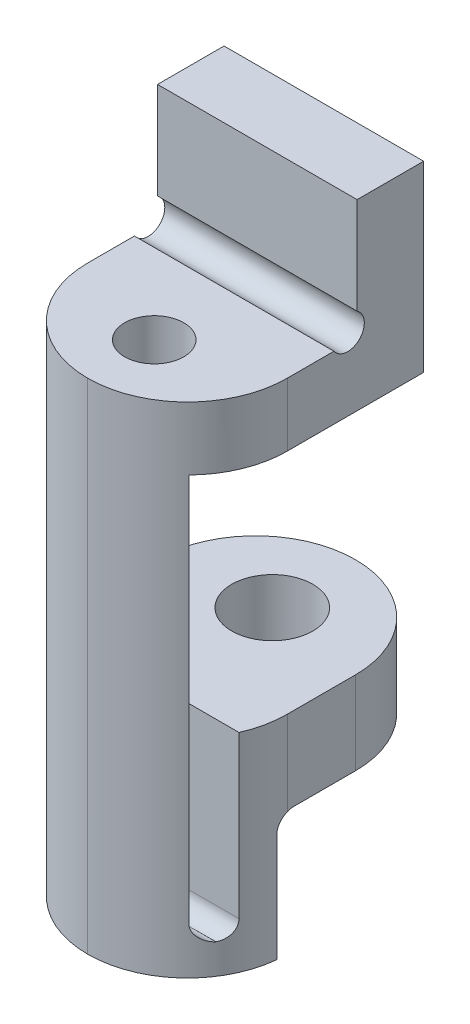
ISO-10303-21;
HEADER;
FILE_DESCRIPTION(('STEP AP214'),'2;1');
FILE_NAME('part.step','',(''),(''),'','','');
FILE_SCHEMA(('AUTOMOTIVE_DESIGN { 1 0 10303 214 1 1 1 1 }'));
ENDSEC;
DATA;
#1=APPLICATION_CONTEXT('core data for automotive mechanical design processes');
#2=APPLICATION_PROTOCOL_DEFINITION('international standard','automotive_design',2000,#1);
#3=PRODUCT_CONTEXT('',#1,'mechanical');
#4=PRODUCT('Part','Part','',(#3));
#5=PRODUCT_RELATED_PRODUCT_CATEGORY('part','',(#4));
#6=PRODUCT_DEFINITION_FORMATION('','',#4);
#7=PRODUCT_DEFINITION_CONTEXT('part definition',#1,'design');
#8=PRODUCT_DEFINITION('design','',#6,#7);
#9=PRODUCT_DEFINITION_SHAPE('','',#8);
#10=(LENGTH_UNIT() NAMED_UNIT(*) SI_UNIT(.MILLI.,.METRE.));
#11=(NAMED_UNIT(*) PLANE_ANGLE_UNIT() SI_UNIT($,.RADIAN.));
#12=(NAMED_UNIT(*) SI_UNIT($,.STERADIAN.) SOLID_ANGLE_UNIT());
#13=UNCERTAINTY_MEASURE_WITH_UNIT(LENGTH_MEASURE(1.E-05),#10,'distance_accuracy_value','');
#14=(GEOMETRIC_REPRESENTATION_CONTEXT(3) GLOBAL_UNCERTAINTY_ASSIGNED_CONTEXT((#13)) GLOBAL_UNIT_ASSIGNED_CONTEXT((#10,
#11,#12)) REPRESENTATION_CONTEXT('',''));
#15=CARTESIAN_POINT('',(0.,0.,0.));
#16=DIRECTION('',(0.,0.,1.));
#17=DIRECTION('',(1.,0.,0.));
#18=AXIS2_PLACEMENT_3D('',#15,#16,#17);
#19=CARTESIAN_POINT('',(1.5,14.5646092602186,0.));
#20=DIRECTION('',(0.,-1.,0.));
#21=DIRECTION('',(0.,0.,-1.));
#22=AXIS2_PLACEMENT_3D('',#19,#20,#21);
#23=PLANE('',#22);
#24=DIRECTION('',(0.,0.,-1.));
#25=VECTOR('',#24,1.);
#26=CARTESIAN_POINT('',(7.5,14.5646092602186,0.));
#27=LINE('',#26,#25);
#28=CARTESIAN_POINT('',(7.5,14.5646092602186,3.90203900205682));
#29=VERTEX_POINT('',#28);
#30=CARTESIAN_POINT('',(7.5,14.5646092602186,2.4971922770932));
#31=VERTEX_POINT('',#30);
#32=EDGE_CURVE('E219',#29,#31,#27,.T.);
#33=ORIENTED_EDGE('',*,*,#32,.T.);
#34=DIRECTION('',(1.,0.,0.));
#35=VECTOR('',#34,1.);
#36=CARTESIAN_POINT('',(-2.5,14.5646092602186,2.4971922770932));
#37=LINE('',#36,#35);
#38=CARTESIAN_POINT('',(1.5,14.5646092602186,2.4971922770932));
#39=VERTEX_POINT('',#38);
#40=EDGE_CURVE('E197',#31,#39,#37,.F.);
#41=ORIENTED_EDGE('',*,*,#40,.T.);
#42=DIRECTION('',(0.,0.,-1.));
#43=VECTOR('',#42,1.);
#44=CARTESIAN_POINT('',(1.5,14.5646092602186,0.));
#45=LINE('',#44,#43);
#46=CARTESIAN_POINT('',(1.5,14.5646092602186,3.90203900205682));
#47=VERTEX_POINT('',#46);
#48=EDGE_CURVE('E493',#47,#39,#45,.T.);
#49=ORIENTED_EDGE('',*,*,#48,.F.);
#50=CARTESIAN_POINT('',(4.5,14.5646092602186,3.90203900205682));
#51=DIRECTION('',(0.,-1.,0.));
#52=DIRECTION('',(0.,0.,-1.));
#53=AXIS2_PLACEMENT_3D('',#50,#51,#52);
#54=CIRCLE('',#53,3.);
#55=CARTESIAN_POINT('',(4.5,14.5646092602186,6.90203900205682));
#56=VERTEX_POINT('',#55);
#57=EDGE_CURVE('E327',#47,#56,#54,.F.);
#58=ORIENTED_EDGE('',*,*,#57,.T.);
#59=CARTESIAN_POINT('',(4.5,14.5646092602186,3.90203900205682));
#60=DIRECTION('',(0.,-1.,0.));
#61=DIRECTION('',(0.,0.,-1.));
#62=AXIS2_PLACEMENT_3D('',#59,#60,#61);
#63=CIRCLE('',#62,3.);
#64=EDGE_CURVE('E324',#56,#29,#63,.F.);
#65=ORIENTED_EDGE('',*,*,#64,.T.);
#66=EDGE_LOOP('',(#33,#41,#49,#58,#65));
#67=FACE_BOUND('',#66,.T.);
#68=CARTESIAN_POINT('',(4.5,14.5646092602186,4.90203900205682));
#69=DIRECTION('',(0.,1.,0.));
#70=DIRECTION('',(0.,0.,1.));
#71=AXIS2_PLACEMENT_3D('',#68,#69,#70);
#72=CIRCLE('',#71,0.888999999999999);
#73=CARTESIAN_POINT('',(4.5,14.5646092602186,5.79103900205682));
#74=VERTEX_POINT('',#73);
#75=EDGE_CURVE('E593',#74,#74,#72,.T.);
#76=ORIENTED_EDGE('',*,*,#75,.F.);
#77=EDGE_LOOP('',(#76));
#78=FACE_BOUND('',#77,.T.);
#79=ADVANCED_FACE('F46',(#67,#78),#23,.F.);
#80=CARTESIAN_POINT('',(7.5,0.,0.));
#81=DIRECTION('',(1.,0.,0.));
#82=DIRECTION('',(0.,0.,-1.));
#83=AXIS2_PLACEMENT_3D('',#80,#81,#82);
#84=PLANE('',#83);
#85=CARTESIAN_POINT('',(7.5,14.8474519726932,2.08488171453144));
#86=DIRECTION('',(1.,0.,0.));
#87=DIRECTION('',(0.,0.,-1.));
#88=AXIS2_PLACEMENT_3D('',#85,#86,#87);
#89=CIRCLE('',#88,0.5);
#90=CARTESIAN_POINT('',(7.5,15.259762535255,1.80203900205682));
#91=VERTEX_POINT('',#90);
#92=EDGE_CURVE('E191',#31,#91,#89,.T.);
#93=ORIENTED_EDGE('',*,*,#92,.F.);
#94=ORIENTED_EDGE('',*,*,#32,.F.);
#95=DIRECTION('',(0.,-1.,0.));
#96=VECTOR('',#95,1.);
#97=CARTESIAN_POINT('',(7.5,0.,3.90203900205681));
#98=LINE('',#97,#96);
#99=CARTESIAN_POINT('',(7.5,12.6646092602186,3.90203900205682));
#100=VERTEX_POINT('',#99);
#101=EDGE_CURVE('E285',#29,#100,#98,.T.);
#102=ORIENTED_EDGE('',*,*,#101,.T.);
#103=DIRECTION('',(0.,0.,1.));
#104=VECTOR('',#103,1.);
#105=CARTESIAN_POINT('',(7.5,12.6646092602186,0.));
#106=LINE('',#105,#104);
#107=CARTESIAN_POINT('',(7.5,12.6646092602186,-0.197960997943182));
#108=VERTEX_POINT('',#107);
#109=EDGE_CURVE('E501',#108,#100,#106,.T.);
#110=ORIENTED_EDGE('',*,*,#109,.F.);
#111=DIRECTION('',(0.,-1.,0.));
#112=VECTOR('',#111,1.);
#113=CARTESIAN_POINT('',(7.5,0.,-0.197960997943184));
#114=LINE('',#113,#112);
#115=CARTESIAN_POINT('',(7.5,18.1646092602186,-0.197960997943181));
#116=VERTEX_POINT('',#115);
#117=EDGE_CURVE('E225',#116,#108,#114,.T.);
#118=ORIENTED_EDGE('',*,*,#117,.F.);
#119=DIRECTION('',(0.,0.,1.));
#120=VECTOR('',#119,1.);
#121=CARTESIAN_POINT('',(7.5,18.1646092602186,0.));
#122=LINE('',#121,#120);
#123=CARTESIAN_POINT('',(7.5,18.1646092602186,1.80203900205682));
#124=VERTEX_POINT('',#123);
#125=EDGE_CURVE('E217',#116,#124,#122,.T.);
#126=ORIENTED_EDGE('',*,*,#125,.T.);
#127=DIRECTION('',(0.,-1.,0.));
#128=VECTOR('',#127,1.);
#129=CARTESIAN_POINT('',(7.5,0.,1.80203900205682));
#130=LINE('',#129,#128);
#131=EDGE_CURVE('E208',#124,#91,#130,.T.);
#132=ORIENTED_EDGE('',*,*,#131,.T.);
#133=EDGE_LOOP('',(#93,#94,#102,#110,#118,#126,#132));
#134=FACE_BOUND('',#133,.T.);
#135=ADVANCED_FACE('F214',(#134),#84,.T.);
#136=CARTESIAN_POINT('',(1.5,0.,0.));
#137=DIRECTION('',(1.,0.,0.));
#138=DIRECTION('',(0.,0.,-1.));
#139=AXIS2_PLACEMENT_3D('',#136,#137,#138);
#140=PLANE('',#139);
#141=DIRECTION('',(0.,0.,1.));
#142=VECTOR('',#141,1.);
#143=CARTESIAN_POINT('',(1.5,5.81460926021861,0.));
#144=LINE('',#143,#142);
#145=CARTESIAN_POINT('',(1.5,5.81460926021861,1.85203900205682));
#146=VERTEX_POINT('',#145);
#147=CARTESIAN_POINT('',(1.5,5.81460926021861,3.90203900205682));
#148=VERTEX_POINT('',#147);
#149=EDGE_CURVE('E231',#146,#148,#144,.T.);
#150=ORIENTED_EDGE('',*,*,#149,.F.);
#151=DIRECTION('',(0.,-1.,0.));
#152=VECTOR('',#151,1.);
#153=CARTESIAN_POINT('',(1.5,0.,1.85203900205682));
#154=LINE('',#153,#152);
#155=CARTESIAN_POINT('',(1.5,3.31460926021861,1.85203900205682));
#156=VERTEX_POINT('',#155);
#157=EDGE_CURVE('E260',#146,#156,#154,.T.);
#158=ORIENTED_EDGE('',*,*,#157,.T.);
#159=DIRECTION('',(0.,0.,-1.));
#160=VECTOR('',#159,1.);
#161=CARTESIAN_POINT('',(1.5,3.31460926021861,0.));
#162=LINE('',#161,#160);
#163=CARTESIAN_POINT('',(1.5,3.31460926021861,3.70203900205682));
#164=VERTEX_POINT('',#163);
#165=EDGE_CURVE('E255',#164,#156,#162,.T.);
#166=ORIENTED_EDGE('',*,*,#165,.F.);
#167=CARTESIAN_POINT('',(1.5,2.81460926021861,3.70203900205682));
#168=DIRECTION('',(1.,0.,0.));
#169=DIRECTION('',(0.,0.,-1.));
#170=AXIS2_PLACEMENT_3D('',#167,#168,#169);
#171=CIRCLE('',#170,0.5);
#172=CARTESIAN_POINT('',(1.5,3.27286682971476,3.90203900205681));
#173=VERTEX_POINT('',#172);
#174=EDGE_CURVE('E57',#164,#173,#171,.T.);
#175=ORIENTED_EDGE('',*,*,#174,.T.);
#176=DIRECTION('',(0.,-1.,0.));
#177=VECTOR('',#176,1.);
#178=CARTESIAN_POINT('',(1.5,14.5646092602186,3.90203900205682));
#179=LINE('',#178,#177);
#180=EDGE_CURVE('E63',#173,#148,#179,.F.);
#181=ORIENTED_EDGE('',*,*,#180,.T.);
#182=EDGE_LOOP('',(#150,#158,#166,#175,#181));
#183=FACE_BOUND('',#182,.T.);
#184=ADVANCED_FACE('F418',(#183),#140,.F.);
#185=CARTESIAN_POINT('',(1.5,3.31460926021861,0.));
#186=DIRECTION('',(0.,-1.,0.));
#187=DIRECTION('',(0.,0.,-1.));
#188=AXIS2_PLACEMENT_3D('',#185,#186,#187);
#189=PLANE('',#188);
#190=CARTESIAN_POINT('',(4.5,3.31460926021861,1.35203900205682));
#191=DIRECTION('',(0.,-1.,0.));
#192=DIRECTION('',(0.,0.,-1.));
#193=AXIS2_PLACEMENT_3D('',#190,#191,#192);
#194=CIRCLE('',#193,1.21919999999999);
#195=CARTESIAN_POINT('',(4.5,3.31460926021861,0.13283900205683));
#196=VERTEX_POINT('',#195);
#197=EDGE_CURVE('E577',#196,#196,#194,.T.);
#198=ORIENTED_EDGE('',*,*,#197,.F.);
#199=EDGE_LOOP('',(#198));
#200=FACE_BOUND('',#199,.T.);
#201=DIRECTION('',(0.,0.,-1.));
#202=VECTOR('',#201,1.);
#203=CARTESIAN_POINT('',(7.5,3.31460926021861,0.));
#204=LINE('',#203,#202);
#205=CARTESIAN_POINT('',(7.5,3.31460926021861,3.70203900205682));
#206=VERTEX_POINT('',#205);
#207=CARTESIAN_POINT('',(7.5,3.31460926021861,1.85203900205682));
#208=VERTEX_POINT('',#207);
#209=EDGE_CURVE('E223',#206,#208,#204,.T.);
#210=ORIENTED_EDGE('',*,*,#209,.F.);
#211=DIRECTION('',(1.,0.,0.));
#212=VECTOR('',#211,1.);
#213=CARTESIAN_POINT('',(1.51503768868014,3.31460926021861,3.70203900205682));
#214=LINE('',#213,#212);
#215=EDGE_CURVE('E354',#206,#164,#214,.F.);
#216=ORIENTED_EDGE('',*,*,#215,.T.);
#217=ORIENTED_EDGE('',*,*,#165,.T.);
#218=CARTESIAN_POINT('',(4.5,3.31460926021861,1.85203900205682));
#219=DIRECTION('',(0.,-1.,0.));
#220=DIRECTION('',(0.,0.,-1.));
#221=AXIS2_PLACEMENT_3D('',#218,#219,#220);
#222=CIRCLE('',#221,3.);
#223=CARTESIAN_POINT('',(4.5,3.31460926021861,-1.14796099794318));
#224=VERTEX_POINT('',#223);
#225=EDGE_CURVE('E268',#156,#224,#222,.T.);
#226=ORIENTED_EDGE('',*,*,#225,.T.);
#227=CARTESIAN_POINT('',(4.5,3.31460926021861,1.85203900205682));
#228=DIRECTION('',(0.,-1.,0.));
#229=DIRECTION('',(0.,0.,-1.));
#230=AXIS2_PLACEMENT_3D('',#227,#228,#229);
#231=CIRCLE('',#230,3.);
#232=EDGE_CURVE('E264',#224,#208,#231,.T.);
#233=ORIENTED_EDGE('',*,*,#232,.T.);
#234=EDGE_LOOP('',(#210,#216,#217,#226,#233));
#235=FACE_BOUND('',#234,.T.);
#236=ADVANCED_FACE('F565',(#200,#235),#189,.T.);
#237=CARTESIAN_POINT('',(1.5,0.,4.20203900205682));
#238=DIRECTION('',(0.,0.,-1.));
#239=DIRECTION('',(-1.,0.,0.));
#240=AXIS2_PLACEMENT_3D('',#237,#238,#239);
#241=PLANE('',#240);
#242=DIRECTION('',(0.,1.,0.));
#243=VECTOR('',#242,1.);
#244=CARTESIAN_POINT('',(1.51503768868014,-0.435390739781383,4.20203900205682));
#245=LINE('',#244,#243);
#246=CARTESIAN_POINT('',(1.51503768868014,-0.435390739781383,4.20203900205682));
#247=VERTEX_POINT('',#246);
#248=CARTESIAN_POINT('',(1.51503768868014,2.81460926021861,4.20203900205682));
#249=VERTEX_POINT('',#248);
#250=EDGE_CURVE('E300',#247,#249,#245,.T.);
#251=ORIENTED_EDGE('',*,*,#250,.T.);
#252=DIRECTION('',(1.,0.,0.));
#253=VECTOR('',#252,1.);
#254=CARTESIAN_POINT('',(7.48496231131986,2.81460926021861,4.20203900205682));
#255=LINE('',#254,#253);
#256=CARTESIAN_POINT('',(7.48496231131986,2.81460926021861,4.20203900205682));
#257=VERTEX_POINT('',#256);
#258=EDGE_CURVE('E350',#249,#257,#255,.T.);
#259=ORIENTED_EDGE('',*,*,#258,.T.);
#260=DIRECTION('',(0.,-1.,0.));
#261=VECTOR('',#260,1.);
#262=CARTESIAN_POINT('',(7.48496231131986,3.31460926021861,4.20203900205682));
#263=LINE('',#262,#261);
#264=CARTESIAN_POINT('',(7.48496231131986,-0.435390739781383,4.20203900205682));
#265=VERTEX_POINT('',#264);
#266=EDGE_CURVE('E297',#257,#265,#263,.T.);
#267=ORIENTED_EDGE('',*,*,#266,.T.);
#268=DIRECTION('',(1.,0.,0.));
#269=VECTOR('',#268,1.);
#270=CARTESIAN_POINT('',(1.5,-0.435390739781383,4.20203900205682));
#271=LINE('',#270,#269);
#272=EDGE_CURVE('E232',#247,#265,#271,.T.);
#273=ORIENTED_EDGE('',*,*,#272,.F.);
#274=EDGE_LOOP('',(#251,#259,#267,#273));
#275=FACE_BOUND('',#274,.T.);
#276=ADVANCED_FACE('F551',(#275),#241,.T.);
#277=CARTESIAN_POINT('',(1.5,-0.435390739781383,0.));
#278=DIRECTION('',(0.,-1.,0.));
#279=DIRECTION('',(0.,0.,-1.));
#280=AXIS2_PLACEMENT_3D('',#277,#278,#279);
#281=PLANE('',#280);
#282=CARTESIAN_POINT('',(4.5,-0.435390739781383,3.90203900205681));
#283=DIRECTION('',(0.,-1.,0.));
#284=DIRECTION('',(0.,0.,-1.));
#285=AXIS2_PLACEMENT_3D('',#282,#283,#284);
#286=CIRCLE('',#285,3.);
#287=CARTESIAN_POINT('',(4.5,-0.435390739781383,6.90203900205682));
#288=VERTEX_POINT('',#287);
#289=EDGE_CURVE('E291',#265,#288,#286,.T.);
#290=ORIENTED_EDGE('',*,*,#289,.T.);
#291=CARTESIAN_POINT('',(4.5,-0.435390739781383,3.90203900205681));
#292=DIRECTION('',(0.,-1.,0.));
#293=DIRECTION('',(0.,0.,-1.));
#294=AXIS2_PLACEMENT_3D('',#291,#292,#293);
#295=CIRCLE('',#294,3.);
#296=EDGE_CURVE('E294',#288,#247,#295,.T.);
#297=ORIENTED_EDGE('',*,*,#296,.T.);
#298=ORIENTED_EDGE('',*,*,#272,.T.);
#299=EDGE_LOOP('',(#290,#297,#298));
#300=FACE_BOUND('',#299,.T.);
#301=ADVANCED_FACE('F424',(#300),#281,.T.);
#302=CARTESIAN_POINT('',(1.5,0.,1.80203900205682));
#303=DIRECTION('',(0.,0.,1.));
#304=DIRECTION('',(0.,-1.,0.));
#305=AXIS2_PLACEMENT_3D('',#302,#303,#304);
#306=PLANE('',#305);
#307=DIRECTION('',(1.,0.,0.));
#308=VECTOR('',#307,1.);
#309=CARTESIAN_POINT('',(-2.5,15.259762535255,1.80203900205682));
#310=LINE('',#309,#308);
#311=CARTESIAN_POINT('',(1.5,15.259762535255,1.80203900205682));
#312=VERTEX_POINT('',#311);
#313=EDGE_CURVE('E194',#91,#312,#310,.F.);
#314=ORIENTED_EDGE('',*,*,#313,.F.);
#315=ORIENTED_EDGE('',*,*,#131,.F.);
#316=DIRECTION('',(1.,0.,0.));
#317=VECTOR('',#316,1.);
#318=CARTESIAN_POINT('',(1.5,18.1646092602186,1.80203900205682));
#319=LINE('',#318,#317);
#320=CARTESIAN_POINT('',(1.5,18.1646092602186,1.80203900205682));
#321=VERTEX_POINT('',#320);
#322=EDGE_CURVE('E237',#321,#124,#319,.T.);
#323=ORIENTED_EDGE('',*,*,#322,.F.);
#324=DIRECTION('',(0.,-1.,0.));
#325=VECTOR('',#324,1.);
#326=CARTESIAN_POINT('',(1.5,0.,1.80203900205682));
#327=LINE('',#326,#325);
#328=EDGE_CURVE('E211',#321,#312,#327,.T.);
#329=ORIENTED_EDGE('',*,*,#328,.T.);
#330=EDGE_LOOP('',(#314,#315,#323,#329));
#331=FACE_BOUND('',#330,.T.);
#332=ADVANCED_FACE('F207',(#331),#306,.T.);
#333=CARTESIAN_POINT('',(1.5,18.1646092602186,0.));
#334=DIRECTION('',(0.,1.,0.));
#335=DIRECTION('',(0.,0.,1.));
#336=AXIS2_PLACEMENT_3D('',#333,#334,#335);
#337=PLANE('',#336);
#338=ORIENTED_EDGE('',*,*,#125,.F.);
#339=DIRECTION('',(1.,0.,0.));
#340=VECTOR('',#339,1.);
#341=CARTESIAN_POINT('',(1.5,18.1646092602186,-0.197960997943181));
#342=LINE('',#341,#340);
#343=CARTESIAN_POINT('',(1.5,18.1646092602186,-0.197960997943181));
#344=VERTEX_POINT('',#343);
#345=EDGE_CURVE('E240',#344,#116,#342,.T.);
#346=ORIENTED_EDGE('',*,*,#345,.F.);
#347=DIRECTION('',(0.,0.,1.));
#348=VECTOR('',#347,1.);
#349=CARTESIAN_POINT('',(1.5,18.1646092602186,0.));
#350=LINE('',#349,#348);
#351=EDGE_CURVE('E487',#344,#321,#350,.T.);
#352=ORIENTED_EDGE('',*,*,#351,.T.);
#353=ORIENTED_EDGE('',*,*,#322,.T.);
#354=EDGE_LOOP('',(#338,#346,#352,#353));
#355=FACE_BOUND('',#354,.T.);
#356=ADVANCED_FACE('F428',(#355),#337,.T.);
#357=CARTESIAN_POINT('',(1.5,0.,-0.197960997943184));
#358=DIRECTION('',(0.,0.,1.));
#359=DIRECTION('',(0.,-1.,0.));
#360=AXIS2_PLACEMENT_3D('',#357,#358,#359);
#361=PLANE('',#360);
#362=ORIENTED_EDGE('',*,*,#117,.T.);
#363=DIRECTION('',(1.,0.,0.));
#364=VECTOR('',#363,1.);
#365=CARTESIAN_POINT('',(1.5,12.6646092602186,-0.197960997943182));
#366=LINE('',#365,#364);
#367=CARTESIAN_POINT('',(1.5,12.6646092602186,-0.197960997943182));
#368=VERTEX_POINT('',#367);
#369=EDGE_CURVE('E243',#368,#108,#366,.T.);
#370=ORIENTED_EDGE('',*,*,#369,.F.);
#371=DIRECTION('',(0.,-1.,0.));
#372=VECTOR('',#371,1.);
#373=CARTESIAN_POINT('',(1.5,0.,-0.197960997943184));
#374=LINE('',#373,#372);
#375=EDGE_CURVE('E480',#344,#368,#374,.T.);
#376=ORIENTED_EDGE('',*,*,#375,.F.);
#377=ORIENTED_EDGE('',*,*,#345,.T.);
#378=EDGE_LOOP('',(#362,#370,#376,#377));
#379=FACE_BOUND('',#378,.T.);
#380=ADVANCED_FACE('F431',(#379),#361,.F.);
#381=CARTESIAN_POINT('',(1.5,12.6646092602186,0.));
#382=DIRECTION('',(0.,1.,0.));
#383=DIRECTION('',(0.,0.,1.));
#384=AXIS2_PLACEMENT_3D('',#381,#382,#383);
#385=PLANE('',#384);
#386=CARTESIAN_POINT('',(4.5,12.6646092602186,4.90203900205682));
#387=DIRECTION('',(0.,1.,0.));
#388=DIRECTION('',(0.,0.,1.));
#389=AXIS2_PLACEMENT_3D('',#386,#387,#388);
#390=CIRCLE('',#389,0.888999999999999);
#391=CARTESIAN_POINT('',(4.5,12.6646092602186,5.79103900205682));
#392=VERTEX_POINT('',#391);
#393=EDGE_CURVE('E340',#392,#392,#390,.T.);
#394=ORIENTED_EDGE('',*,*,#393,.T.);
#395=EDGE_LOOP('',(#394));
#396=FACE_BOUND('',#395,.T.);
#397=DIRECTION('',(1.,0.,0.));
#398=VECTOR('',#397,1.);
#399=CARTESIAN_POINT('',(1.5,12.6646092602186,6.00203900205682));
#400=LINE('',#399,#398);
#401=CARTESIAN_POINT('',(2.35757147143715,12.6646092602186,6.00203900205682));
#402=VERTEX_POINT('',#401);
#403=CARTESIAN_POINT('',(6.64242852856285,12.6646092602186,6.00203900205682));
#404=VERTEX_POINT('',#403);
#405=EDGE_CURVE('E247',#402,#404,#400,.T.);
#406=ORIENTED_EDGE('',*,*,#405,.F.);
#407=CARTESIAN_POINT('',(4.5,12.6646092602186,3.90203900205682));
#408=DIRECTION('',(0.,1.,0.));
#409=DIRECTION('',(0.,0.,1.));
#410=AXIS2_PLACEMENT_3D('',#407,#408,#409);
#411=CIRCLE('',#410,3.);
#412=CARTESIAN_POINT('',(1.5,12.6646092602186,3.90203900205682));
#413=VERTEX_POINT('',#412);
#414=EDGE_CURVE('E321',#402,#413,#411,.F.);
#415=ORIENTED_EDGE('',*,*,#414,.T.);
#416=DIRECTION('',(0.,0.,1.));
#417=VECTOR('',#416,1.);
#418=CARTESIAN_POINT('',(1.5,12.6646092602186,0.));
#419=LINE('',#418,#417);
#420=EDGE_CURVE('E476',#368,#413,#419,.T.);
#421=ORIENTED_EDGE('',*,*,#420,.F.);
#422=ORIENTED_EDGE('',*,*,#369,.T.);
#423=ORIENTED_EDGE('',*,*,#109,.T.);
#424=CARTESIAN_POINT('',(4.5,12.6646092602186,3.90203900205682));
#425=DIRECTION('',(0.,1.,0.));
#426=DIRECTION('',(0.,0.,1.));
#427=AXIS2_PLACEMENT_3D('',#424,#425,#426);
#428=CIRCLE('',#427,3.);
#429=EDGE_CURVE('E318',#100,#404,#428,.F.);
#430=ORIENTED_EDGE('',*,*,#429,.T.);
#431=EDGE_LOOP('',(#406,#415,#421,#422,#423,#430));
#432=FACE_BOUND('',#431,.T.);
#433=ADVANCED_FACE('F435',(#396,#432),#385,.F.);
#434=CARTESIAN_POINT('',(1.5,0.,6.00203900205682));
#435=DIRECTION('',(0.,0.,1.));
#436=DIRECTION('',(0.,-1.,0.));
#437=AXIS2_PLACEMENT_3D('',#434,#435,#436);
#438=PLANE('',#437);
#439=DIRECTION('',(0.,-1.,0.));
#440=VECTOR('',#439,1.);
#441=CARTESIAN_POINT('',(6.64242852856285,12.6646092602186,6.00203900205682));
#442=LINE('',#441,#440);
#443=CARTESIAN_POINT('',(6.64242852856285,0.964609260218617,6.00203900205682));
#444=VERTEX_POINT('',#443);
#445=EDGE_CURVE('E311',#404,#444,#442,.T.);
#446=ORIENTED_EDGE('',*,*,#445,.T.);
#447=DIRECTION('',(1.,0.,0.));
#448=VECTOR('',#447,1.);
#449=CARTESIAN_POINT('',(2.35757147143715,0.964609260218617,6.00203900205682));
#450=LINE('',#449,#448);
#451=CARTESIAN_POINT('',(2.35757147143715,0.964609260218617,6.00203900205682));
#452=VERTEX_POINT('',#451);
#453=EDGE_CURVE('E347',#444,#452,#450,.F.);
#454=ORIENTED_EDGE('',*,*,#453,.T.);
#455=DIRECTION('',(0.,1.,0.));
#456=VECTOR('',#455,1.);
#457=CARTESIAN_POINT('',(2.35757147143715,0.464609260218617,6.00203900205682));
#458=LINE('',#457,#456);
#459=EDGE_CURVE('E315',#452,#402,#458,.T.);
#460=ORIENTED_EDGE('',*,*,#459,.T.);
#461=ORIENTED_EDGE('',*,*,#405,.T.);
#462=EDGE_LOOP('',(#446,#454,#460,#461));
#463=FACE_BOUND('',#462,.T.);
#464=ADVANCED_FACE('F439',(#463),#438,.F.);
#465=CARTESIAN_POINT('',(1.5,0.,5.10203900205682));
#466=DIRECTION('',(0.,0.,1.));
#467=DIRECTION('',(0.,-1.,0.));
#468=AXIS2_PLACEMENT_3D('',#465,#466,#467);
#469=PLANE('',#468);
#470=DIRECTION('',(0.,1.,0.));
#471=VECTOR('',#470,1.);
#472=CARTESIAN_POINT('',(1.7504545830265,5.81460926021861,5.10203900205682));
#473=LINE('',#472,#471);
#474=CARTESIAN_POINT('',(1.7504545830265,5.81460926021861,5.10203900205682));
#475=VERTEX_POINT('',#474);
#476=CARTESIAN_POINT('',(1.7504545830265,0.964609260218617,5.10203900205682));
#477=VERTEX_POINT('',#476);
#478=EDGE_CURVE('E307',#475,#477,#473,.F.);
#479=ORIENTED_EDGE('',*,*,#478,.T.);
#480=DIRECTION('',(1.,0.,0.));
#481=VECTOR('',#480,1.);
#482=CARTESIAN_POINT('',(1.5,0.964609260218617,5.10203900205682));
#483=LINE('',#482,#481);
#484=CARTESIAN_POINT('',(7.2495454169735,0.964609260218617,5.10203900205682));
#485=VERTEX_POINT('',#484);
#486=EDGE_CURVE('E343',#477,#485,#483,.T.);
#487=ORIENTED_EDGE('',*,*,#486,.T.);
#488=DIRECTION('',(0.,-1.,0.));
#489=VECTOR('',#488,1.);
#490=CARTESIAN_POINT('',(7.2495454169735,0.464609260218617,5.10203900205682));
#491=LINE('',#490,#489);
#492=CARTESIAN_POINT('',(7.2495454169735,5.81460926021861,5.10203900205682));
#493=VERTEX_POINT('',#492);
#494=EDGE_CURVE('E304',#485,#493,#491,.F.);
#495=ORIENTED_EDGE('',*,*,#494,.T.);
#496=DIRECTION('',(1.,0.,0.));
#497=VECTOR('',#496,1.);
#498=CARTESIAN_POINT('',(1.5,5.81460926021861,5.10203900205682));
#499=LINE('',#498,#497);
#500=EDGE_CURVE('E251',#475,#493,#499,.T.);
#501=ORIENTED_EDGE('',*,*,#500,.F.);
#502=EDGE_LOOP('',(#479,#487,#495,#501));
#503=FACE_BOUND('',#502,.T.);
#504=ADVANCED_FACE('F443',(#503),#469,.T.);
#505=CARTESIAN_POINT('',(1.5,5.81460926021861,0.));
#506=DIRECTION('',(0.,1.,0.));
#507=DIRECTION('',(0.,0.,1.));
#508=AXIS2_PLACEMENT_3D('',#505,#506,#507);
#509=PLANE('',#508);
#510=CARTESIAN_POINT('',(4.5,5.81460926021861,1.35203900205682));
#511=DIRECTION('',(0.,1.,0.));
#512=DIRECTION('',(0.,0.,1.));
#513=AXIS2_PLACEMENT_3D('',#510,#511,#512);
#514=CIRCLE('',#513,1.21919999999999);
#515=CARTESIAN_POINT('',(4.5,5.81460926021861,2.57123900205681));
#516=VERTEX_POINT('',#515);
#517=EDGE_CURVE('E589',#516,#516,#514,.T.);
#518=ORIENTED_EDGE('',*,*,#517,.F.);
#519=EDGE_LOOP('',(#518));
#520=FACE_BOUND('',#519,.T.);
#521=CARTESIAN_POINT('',(4.5,5.81460926021861,1.85203900205682));
#522=DIRECTION('',(0.,1.,0.));
#523=DIRECTION('',(0.,0.,1.));
#524=AXIS2_PLACEMENT_3D('',#521,#522,#523);
#525=CIRCLE('',#524,3.);
#526=CARTESIAN_POINT('',(7.5,5.81460926021861,1.85203900205682));
#527=VERTEX_POINT('',#526);
#528=CARTESIAN_POINT('',(4.5,5.81460926021861,-1.14796099794318));
#529=VERTEX_POINT('',#528);
#530=EDGE_CURVE('E277',#527,#529,#525,.T.);
#531=ORIENTED_EDGE('',*,*,#530,.T.);
#532=CARTESIAN_POINT('',(4.5,5.81460926021861,1.85203900205682));
#533=DIRECTION('',(0.,1.,0.));
#534=DIRECTION('',(0.,0.,1.));
#535=AXIS2_PLACEMENT_3D('',#532,#533,#534);
#536=CIRCLE('',#535,3.);
#537=EDGE_CURVE('E280',#529,#146,#536,.T.);
#538=ORIENTED_EDGE('',*,*,#537,.T.);
#539=ORIENTED_EDGE('',*,*,#149,.T.);
#540=CARTESIAN_POINT('',(4.5,5.81460926021861,3.90203900205682));
#541=DIRECTION('',(0.,1.,0.));
#542=DIRECTION('',(0.,0.,1.));
#543=AXIS2_PLACEMENT_3D('',#540,#541,#542);
#544=CIRCLE('',#543,3.);
#545=EDGE_CURVE('E274',#148,#475,#544,.T.);
#546=ORIENTED_EDGE('',*,*,#545,.T.);
#547=ORIENTED_EDGE('',*,*,#500,.T.);
#548=CARTESIAN_POINT('',(4.5,5.81460926021861,3.90203900205682));
#549=DIRECTION('',(0.,1.,0.));
#550=DIRECTION('',(0.,0.,1.));
#551=AXIS2_PLACEMENT_3D('',#548,#549,#550);
#552=CIRCLE('',#551,3.);
#553=CARTESIAN_POINT('',(7.5,5.81460926021861,3.90203900205682));
#554=VERTEX_POINT('',#553);
#555=EDGE_CURVE('E271',#493,#554,#552,.T.);
#556=ORIENTED_EDGE('',*,*,#555,.T.);
#557=DIRECTION('',(0.,0.,1.));
#558=VECTOR('',#557,1.);
#559=CARTESIAN_POINT('',(7.5,5.81460926021861,0.));
#560=LINE('',#559,#558);
#561=EDGE_CURVE('E335',#527,#554,#560,.T.);
#562=ORIENTED_EDGE('',*,*,#561,.F.);
#563=EDGE_LOOP('',(#531,#538,#539,#546,#547,#556,#562));
#564=FACE_BOUND('',#563,.T.);
#565=ADVANCED_FACE('F447',(#520,#564),#509,.T.);
#566=ORIENTED_EDGE('',*,*,#48,.T.);
#567=CARTESIAN_POINT('',(1.5,14.8474519726932,2.08488171453144));
#568=DIRECTION('',(1.,0.,0.));
#569=DIRECTION('',(0.,0.,-1.));
#570=AXIS2_PLACEMENT_3D('',#567,#568,#569);
#571=CIRCLE('',#570,0.5);
#572=EDGE_CURVE('E330',#39,#312,#571,.T.);
#573=ORIENTED_EDGE('',*,*,#572,.T.);
#574=ORIENTED_EDGE('',*,*,#328,.F.);
#575=ORIENTED_EDGE('',*,*,#351,.F.);
#576=ORIENTED_EDGE('',*,*,#375,.T.);
#577=ORIENTED_EDGE('',*,*,#420,.T.);
#578=DIRECTION('',(0.,-1.,0.));
#579=VECTOR('',#578,1.);
#580=CARTESIAN_POINT('',(1.5,14.5646092602186,3.90203900205682));
#581=LINE('',#580,#579);
#582=EDGE_CURVE('E236',#413,#47,#581,.F.);
#583=ORIENTED_EDGE('',*,*,#582,.T.);
#584=EDGE_LOOP('',(#566,#573,#574,#575,#576,#577,#583));
#585=FACE_BOUND('',#584,.T.);
#586=ADVANCED_FACE('F451',(#585),#140,.F.);
#587=DIRECTION('',(0.,-1.,0.));
#588=VECTOR('',#587,1.);
#589=CARTESIAN_POINT('',(7.5,0.,3.90203900205681));
#590=LINE('',#589,#588);
#591=CARTESIAN_POINT('',(7.5,3.27286682971476,3.90203900205681));
#592=VERTEX_POINT('',#591);
#593=EDGE_CURVE('E71',#554,#592,#590,.T.);
#594=ORIENTED_EDGE('',*,*,#593,.T.);
#595=CARTESIAN_POINT('',(7.5,2.81460926021861,3.70203900205682));
#596=DIRECTION('',(1.,0.,0.));
#597=DIRECTION('',(0.,0.,-1.));
#598=AXIS2_PLACEMENT_3D('',#595,#596,#597);
#599=CIRCLE('',#598,0.5);
#600=EDGE_CURVE('E527',#592,#206,#599,.F.);
#601=ORIENTED_EDGE('',*,*,#600,.T.);
#602=ORIENTED_EDGE('',*,*,#209,.T.);
#603=DIRECTION('',(0.,-1.,0.));
#604=VECTOR('',#603,1.);
#605=CARTESIAN_POINT('',(7.5,5.81460926021861,1.85203900205682));
#606=LINE('',#605,#604);
#607=EDGE_CURVE('E288',#208,#527,#606,.F.);
#608=ORIENTED_EDGE('',*,*,#607,.T.);
#609=ORIENTED_EDGE('',*,*,#561,.T.);
#610=EDGE_LOOP('',(#594,#601,#602,#608,#609));
#611=FACE_BOUND('',#610,.T.);
#612=ADVANCED_FACE('F420',(#611),#84,.T.);
#613=CARTESIAN_POINT('',(4.5,0.,1.85203900205682));
#614=DIRECTION('',(0.,1.,0.));
#615=DIRECTION('',(0.,0.,1.));
#616=AXIS2_PLACEMENT_3D('',#613,#614,#615);
#617=CYLINDRICAL_SURFACE('',#616,3.);
#618=DIRECTION('',(0.,-1.,0.));
#619=VECTOR('',#618,1.);
#620=CARTESIAN_POINT('',(4.5,3.31460926021861,-1.14796099794318));
#621=LINE('',#620,#619);
#622=EDGE_CURVE('E331',#529,#224,#621,.T.);
#623=ORIENTED_EDGE('',*,*,#622,.F.);
#624=ORIENTED_EDGE('',*,*,#530,.F.);
#625=ORIENTED_EDGE('',*,*,#607,.F.);
#626=ORIENTED_EDGE('',*,*,#232,.F.);
#627=EDGE_LOOP('',(#623,#624,#625,#626));
#628=FACE_BOUND('',#627,.T.);
#629=ADVANCED_FACE('F454',(#628),#617,.T.);
#630=CARTESIAN_POINT('',(4.5,0.,1.85203900205682));
#631=DIRECTION('',(0.,-1.,0.));
#632=DIRECTION('',(0.,0.,-1.));
#633=AXIS2_PLACEMENT_3D('',#630,#631,#632);
#634=CYLINDRICAL_SURFACE('',#633,3.);
#635=ORIENTED_EDGE('',*,*,#537,.F.);
#636=ORIENTED_EDGE('',*,*,#622,.T.);
#637=ORIENTED_EDGE('',*,*,#225,.F.);
#638=ORIENTED_EDGE('',*,*,#157,.F.);
#639=EDGE_LOOP('',(#635,#636,#637,#638));
#640=FACE_BOUND('',#639,.T.);
#641=ADVANCED_FACE('F379',(#640),#634,.T.);
#642=CARTESIAN_POINT('',(4.5,0.,3.90203900205681));
#643=DIRECTION('',(0.,-1.,0.));
#644=DIRECTION('',(0.,0.,-1.));
#645=AXIS2_PLACEMENT_3D('',#642,#643,#644);
#646=CYLINDRICAL_SURFACE('',#645,3.);
#647=ORIENTED_EDGE('',*,*,#101,.F.);
#648=ORIENTED_EDGE('',*,*,#64,.F.);
#649=DIRECTION('',(0.,-1.,0.));
#650=VECTOR('',#649,1.);
#651=CARTESIAN_POINT('',(4.5,0.,6.90203900205681));
#652=LINE('',#651,#650);
#653=EDGE_CURVE('E336',#288,#56,#652,.F.);
#654=ORIENTED_EDGE('',*,*,#653,.F.);
#655=ORIENTED_EDGE('',*,*,#289,.F.);
#656=ORIENTED_EDGE('',*,*,#266,.F.);
#657=CARTESIAN_POINT('',(7.48496231131986,2.81460926021861,4.20203900205682));
#658=CARTESIAN_POINT('',(7.48494861051875,2.84268055936975,4.20206321990182));
#659=CARTESIAN_POINT('',(7.48519958321568,2.87074272647442,4.19967653348121));
#660=CARTESIAN_POINT('',(7.48612914364645,2.92604058342642,4.19026254425156));
#661=CARTESIAN_POINT('',(7.48680727086356,2.95327713027465,4.18324023872833));
#662=CARTESIAN_POINT('',(7.4884900515751,3.00618674884731,4.16473288888957));
#663=CARTESIAN_POINT('',(7.48949479690274,3.03185937844136,4.15324658928231));
#664=CARTESIAN_POINT('',(7.49164891465717,3.08092074893948,4.12614174386487));
#665=CARTESIAN_POINT('',(7.49279831134827,3.10430910550002,4.1105225042954));
#666=CARTESIAN_POINT('',(7.49503086557151,3.14822440164262,4.07552637067862));
#667=CARTESIAN_POINT('',(7.49611376004699,3.16874034301737,4.05613567822232));
#668=CARTESIAN_POINT('',(7.49797638600887,3.20621626031477,4.01418155871927));
#669=CARTESIAN_POINT('',(7.49875643853638,3.22317999307549,3.99162152622697));
#670=CARTESIAN_POINT('',(7.49950962974333,3.24472359160907,3.9572971505468));
#671=CARTESIAN_POINT('',(7.49969015587061,3.25093276907052,3.94653097685161));
#672=CARTESIAN_POINT('',(7.49993531766087,3.26252266431407,3.92458565872782));
#673=CARTESIAN_POINT('',(7.50000016593296,3.2679048853132,3.91340731054398));
#674=CARTESIAN_POINT('',(7.50000000000003,3.27286682971433,3.90203900205655));
#675=B_SPLINE_CURVE_WITH_KNOTS('',3,(#657,#658,#659,#660,#661,#662,#663,#664,#665,#666,#667,
#668,#669,#670,#671,#672,#673,#674),.UNSPECIFIED.,.F.,.F.,(4,2,2,2,2,2,2,2,4),(0.,
0.0840981020216892,0.16810569241302,0.252136923163799,0.336182268436059,0.420541095152962,
0.504810247736436,0.542070212003215,0.579261623809041),.UNSPECIFIED.);
#676=EDGE_CURVE('E525',#257,#592,#675,.T.);
#677=ORIENTED_EDGE('',*,*,#676,.T.);
#678=ORIENTED_EDGE('',*,*,#593,.F.);
#679=ORIENTED_EDGE('',*,*,#555,.F.);
#680=ORIENTED_EDGE('',*,*,#494,.F.);
#681=CARTESIAN_POINT('',(7.2495454169735,0.964609260218617,5.10203900205682));
#682=CARTESIAN_POINT('',(7.24954811713668,0.938391155137379,5.10200815392647));
#683=CARTESIAN_POINT('',(7.24864619906555,0.912188133066661,5.10409913218496));
#684=CARTESIAN_POINT('',(7.24505563580905,0.860605551082513,5.11228898331504));
#685=CARTESIAN_POINT('',(7.24237136731398,0.835224133378611,5.11837803821338));
#686=CARTESIAN_POINT('',(7.23523847560209,0.785942900649554,5.1343302787271));
#687=CARTESIAN_POINT('',(7.23078987092031,0.762043070062795,5.14419342469415));
#688=CARTESIAN_POINT('',(7.22017148846577,0.716339598349188,5.16727770379591));
#689=CARTESIAN_POINT('',(7.2140012464989,0.694536524692418,5.18049974248128));
#690=CARTESIAN_POINT('',(7.19984959754974,0.653052734918316,5.21012405079244));
#691=CARTESIAN_POINT('',(7.19182948911136,0.633432999973357,5.22659299103522));
#692=CARTESIAN_POINT('',(7.17417981316091,0.597286515048897,5.2618739878646));
#693=CARTESIAN_POINT('',(7.16455030629802,0.580759648566285,5.28068595614884));
#694=CARTESIAN_POINT('',(7.14306200526128,0.549900096778124,5.32147246291084));
#695=CARTESIAN_POINT('',(7.13109115943472,0.535819221530632,5.34357792970994));
#696=CARTESIAN_POINT('',(7.10566171192389,0.511505200714618,5.38905251116745));
#697=CARTESIAN_POINT('',(7.09220067699328,0.501278471922765,5.41242365973849));
#698=CARTESIAN_POINT('',(7.06178756972171,0.483296921193092,5.46353031428682));
#699=CARTESIAN_POINT('',(7.0446212496913,0.476197398773574,5.49136690351094));
#700=CARTESIAN_POINT('',(7.00906360792179,0.466856021142448,5.54694503689832));
#701=CARTESIAN_POINT('',(6.9906767210419,0.464597476157835,5.57468657733257));
#702=CARTESIAN_POINT('',(6.97184141886165,0.464609260218617,5.60203900205682));
#703=B_SPLINE_CURVE_WITH_KNOTS('',3,(#681,#682,#683,#684,#685,#686,#687,#688,#689,#690,#691,
#692,#693,#694,#695,#696,#697,#698,#699,#700,#701,#702),.UNSPECIFIED.,.F.,.F.,(4,2,2,2,2,2,2,2,
2,2,4),(0.,0.0785324340713089,0.156872735732061,0.23521221441903,0.313572835725404,
0.393751603243728,0.473927349955648,0.56001776347554,0.646250882472299,0.746251110993447,
0.845906020066848),.UNSPECIFIED.);
#704=CARTESIAN_POINT('',(7.00549396327347,0.467115541660916,5.55203900205874));
#705=VERTEX_POINT('',#704);
#706=EDGE_CURVE('E357',#485,#705,#703,.T.);
#707=ORIENTED_EDGE('',*,*,#706,.T.);
#708=CARTESIAN_POINT('',(7.0377155080899,0.464609260218617,5.50203900205682));
#709=CARTESIAN_POINT('',(7.01505769292952,0.464640068132776,5.53804184496267));
#710=CARTESIAN_POINT('',(6.99160678850067,0.468494465931919,5.57347658997105));
#711=CARTESIAN_POINT('',(6.94392696522734,0.483415029326664,5.64242002474885));
#712=CARTESIAN_POINT('',(6.91969586627209,0.494503442003592,5.67592242481604));
#713=CARTESIAN_POINT('',(6.87268287538489,0.522690510065497,5.73829526337411));
#714=CARTESIAN_POINT('',(6.84989172062323,0.539442845451491,5.76731657296262));
#715=CARTESIAN_POINT('',(6.80544248938,0.578898535758154,5.82197786136205));
#716=CARTESIAN_POINT('',(6.78378268474268,0.601592475736324,5.84762309406865));
#717=CARTESIAN_POINT('',(6.74882260636887,0.645557699118987,5.88781159756751));
#718=CARTESIAN_POINT('',(6.7349084941184,0.665364449342664,5.90342764786336));
#719=CARTESIAN_POINT('',(6.70904848603731,0.708005342431274,5.93193382035451));
#720=CARTESIAN_POINT('',(6.69709960564913,0.730834797785817,5.94482808467234));
#721=CARTESIAN_POINT('',(6.67826614659931,0.774275130886802,5.96487825246387));
#722=CARTESIAN_POINT('',(6.67084512893624,0.794358127538577,5.97266996176759));
#723=CARTESIAN_POINT('',(6.65833571496107,0.836004191431671,5.98570620426743));
#724=CARTESIAN_POINT('',(6.65324176253642,0.85756359043681,5.99095680642479));
#725=CARTESIAN_POINT('',(6.64720659963611,0.893488302962103,5.99715601802102));
#726=CARTESIAN_POINT('',(6.64542645359661,0.907568860231523,5.99897732168829));
#727=CARTESIAN_POINT('',(6.64303238367102,0.935964802916208,6.00142297595628));
#728=CARTESIAN_POINT('',(6.64242126644012,0.950280670454542,6.00204444597721));
#729=CARTESIAN_POINT('',(6.64242852856285,0.964609260218617,6.00203900205682));
#730=B_SPLINE_CURVE_WITH_KNOTS('',3,(#708,#709,#710,#711,#712,#713,#714,#715,#716,#717,#718,
#719,#720,#721,#722,#723,#724,#725,#726,#727,#728,#729),.UNSPECIFIED.,.F.,.F.,(4,2,2,2,2,2,2,2,
2,2,4),(0.,0.12736422942574,0.255122005833144,0.376168584810601,0.497024504730995,
0.583157735165578,0.669158924198986,0.737252363816301,0.805182362388982,0.848016419534455,
0.890953186109294),.UNSPECIFIED.);
#731=EDGE_CURVE('E386',#705,#444,#730,.T.);
#732=ORIENTED_EDGE('',*,*,#731,.T.);
#733=ORIENTED_EDGE('',*,*,#445,.F.);
#734=ORIENTED_EDGE('',*,*,#429,.F.);
#735=EDGE_LOOP('',(#647,#648,#654,#655,#656,#677,#678,#679,#680,#707,#732,#733,#734));
#736=FACE_BOUND('',#735,.T.);
#737=ADVANCED_FACE('F375',(#736),#646,.T.);
#738=CARTESIAN_POINT('',(4.5,0.,3.90203900205681));
#739=DIRECTION('',(0.,1.,0.));
#740=DIRECTION('',(0.,0.,1.));
#741=AXIS2_PLACEMENT_3D('',#738,#739,#740);
#742=CYLINDRICAL_SURFACE('',#741,3.);
#743=ORIENTED_EDGE('',*,*,#545,.F.);
#744=ORIENTED_EDGE('',*,*,#180,.F.);
#745=CARTESIAN_POINT('',(1.5,3.27286682971476,3.90203900205681));
#746=CARTESIAN_POINT('',(1.49999271723425,3.261662265136,3.92777163872071));
#747=CARTESIAN_POINT('',(1.50033122089098,3.24825414308031,3.95252974243592));
#748=CARTESIAN_POINT('',(1.50149152447105,3.21751872227776,3.99943222998435));
#749=CARTESIAN_POINT('',(1.5023128118568,3.20019559180789,4.02157935581859));
#750=CARTESIAN_POINT('',(1.50423145041037,3.16208877919423,4.06265632079323));
#751=CARTESIAN_POINT('',(1.50532885319046,3.14130445031936,4.08158555732699));
#752=CARTESIAN_POINT('',(1.50756958958792,3.09686085967189,4.1157035204107));
#753=CARTESIAN_POINT('',(1.50871293004604,3.07320116864845,4.13089168744506));
#754=CARTESIAN_POINT('',(1.5108379073267,3.02355930917102,4.15715720958006));
#755=CARTESIAN_POINT('',(1.51181878816877,2.99756710540468,4.16821563101219));
#756=CARTESIAN_POINT('',(1.51343687966297,2.94409440225812,4.18579888846405));
#757=CARTESIAN_POINT('',(1.51407444381264,2.91661546591517,4.19232838971034));
#758=CARTESIAN_POINT('',(1.5146685354427,2.87652090168852,4.19834746402238));
#759=CARTESIAN_POINT('',(1.51480656706721,2.86416739212694,4.19973226706035));
#760=CARTESIAN_POINT('',(1.51499118695943,2.83941421402212,4.20157697054939));
#761=CARTESIAN_POINT('',(1.51503794695606,2.82701467622903,4.20203860799044));
#762=CARTESIAN_POINT('',(1.51503768868014,2.81460926021861,4.20203900205682));
#763=B_SPLINE_CURVE_WITH_KNOTS('',3,(#745,#746,#747,#748,#749,#750,#751,#752,#753,#754,#755,
#756,#757,#758,#759,#760,#761,#762),.UNSPECIFIED.,.F.,.F.,(4,2,2,2,2,2,2,2,4),(0.,
0.0840783595824503,0.168067619866078,0.252072591337711,0.336090119002162,0.420488246375429,
0.504799305867583,0.542065365518825,0.579261240679537),.UNSPECIFIED.);
#764=EDGE_CURVE('E11',#173,#249,#763,.T.);
#765=ORIENTED_EDGE('',*,*,#764,.T.);
#766=ORIENTED_EDGE('',*,*,#250,.F.);
#767=ORIENTED_EDGE('',*,*,#296,.F.);
#768=ORIENTED_EDGE('',*,*,#653,.T.);
#769=ORIENTED_EDGE('',*,*,#57,.F.);
#770=ORIENTED_EDGE('',*,*,#582,.F.);
#771=ORIENTED_EDGE('',*,*,#414,.F.);
#772=ORIENTED_EDGE('',*,*,#459,.F.);
#773=CARTESIAN_POINT('',(2.35757147143715,0.964609260218617,6.00203900205682));
#774=CARTESIAN_POINT('',(2.35761972844643,0.941592621253056,6.00207672231478));
#775=CARTESIAN_POINT('',(2.35601600645139,0.918646681398431,6.00045260051096));
#776=CARTESIAN_POINT('',(2.34993253761811,0.873774794381354,5.9942246279946));
#777=CARTESIAN_POINT('',(2.3454809159999,0.85184109708675,5.98964991310403));
#778=CARTESIAN_POINT('',(2.33413450967798,0.809472515406311,5.97787343871502));
#779=CARTESIAN_POINT('',(2.32724822344757,0.789032712154694,5.97068081478394));
#780=CARTESIAN_POINT('',(2.31154461788623,0.749829912081149,5.95406123108441));
#781=CARTESIAN_POINT('',(2.30272194888131,0.731071767507896,5.94462807531074));
#782=CARTESIAN_POINT('',(2.27946636690728,0.687643570173298,5.91937303693584));
#783=CARTESIAN_POINT('',(2.26426466288936,0.663962381489821,5.90255898153112));
#784=CARTESIAN_POINT('',(2.23201630106905,0.620520930587962,5.86592501320017));
#785=CARTESIAN_POINT('',(2.21496696830877,0.600766473828717,5.84610072501701));
#786=CARTESIAN_POINT('',(2.17944153649318,0.564763760152547,5.80356271084688));
#787=CARTESIAN_POINT('',(2.1609420928078,0.548603556045967,5.7807943901438));
#788=CARTESIAN_POINT('',(2.12350712276302,0.520399077827561,5.7332136400018));
#789=CARTESIAN_POINT('',(2.10457191176643,0.508351921267646,5.70840265726945));
#790=CARTESIAN_POINT('',(2.06467702582449,0.487382341286398,5.6543062838852));
#791=CARTESIAN_POINT('',(2.04372164788612,0.478943630556593,5.62482795953974));
#792=CARTESIAN_POINT('',(2.00240641632455,0.467562184048897,5.56438710496395));
#793=CARTESIAN_POINT('',(1.98204723085439,0.464625398451674,5.53342300496794));
#794=CARTESIAN_POINT('',(1.9622844919101,0.464609260218617,5.50203900205682));
#795=B_SPLINE_CURVE_WITH_KNOTS('',3,(#773,#774,#775,#776,#777,#778,#779,#780,#781,#782,#783,
#784,#785,#786,#787,#788,#789,#790,#791,#792,#793,#794),.UNSPECIFIED.,.F.,.F.,(4,2,2,2,2,2,2,2,
2,2,4),(0.,0.0688249733778026,0.136980524331374,0.204900481991352,0.273010499602942,
0.370820447743961,0.468773944258472,0.568912715983963,0.668981165116677,0.779956805715723,
0.891052394290223),.UNSPECIFIED.);
#796=CARTESIAN_POINT('',(1.99450603672633,0.467115541660948,5.55203900205842));
#797=VERTEX_POINT('',#796);
#798=EDGE_CURVE('E393',#452,#797,#795,.T.);
#799=ORIENTED_EDGE('',*,*,#798,.T.);
#800=CARTESIAN_POINT('',(2.02815858113835,0.464609260218617,5.60203900205682));
#801=CARTESIAN_POINT('',(2.01608620790652,0.46461400545707,5.58448700448238));
#802=CARTESIAN_POINT('',(2.00420910942388,0.465535172759694,5.56681431655456));
#803=CARTESIAN_POINT('',(1.98090463027173,0.469309452744438,5.53133651611431));
#804=CARTESIAN_POINT('',(1.96947806808799,0.472165924291944,5.51353122668637));
#805=CARTESIAN_POINT('',(1.93598736804254,0.483796158174368,5.46011231877599));
#806=CARTESIAN_POINT('',(1.91475419185662,0.495631406175056,5.4245568464315));
#807=CARTESIAN_POINT('',(1.8810465043729,0.52322878829299,5.36556026476326));
#808=CARTESIAN_POINT('',(1.86780334565455,0.536901205050779,5.34156163031145));
#809=CARTESIAN_POINT('',(1.843179220456,0.568550243388831,5.29558795876608));
#810=CARTESIAN_POINT('',(1.83179374550538,0.586516175348404,5.27360808077348));
#811=CARTESIAN_POINT('',(1.81102863552322,0.626632706514523,5.23244105557776));
#812=CARTESIAN_POINT('',(1.80166053254273,0.648806068676819,5.21327015476683));
#813=CARTESIAN_POINT('',(1.78518138737657,0.696761576039044,5.17880313626098));
#814=CARTESIAN_POINT('',(1.77807151719719,0.722545585169039,5.16350903142347));
#815=CARTESIAN_POINT('',(1.76678289207941,0.77434993062385,5.13884600858472));
#816=CARTESIAN_POINT('',(1.76239341885901,0.800126475390498,5.12905905883448));
#817=CARTESIAN_POINT('',(1.75562330760621,0.85315820289595,5.11384230888536));
#818=CARTESIAN_POINT('',(1.75323862482997,0.880410289785617,5.10840373675409));
#819=CARTESIAN_POINT('',(1.75139311836521,0.917341723333724,5.10418743155408));
#820=CARTESIAN_POINT('',(1.75104091352438,0.926781665583344,5.10338165644113));
#821=CARTESIAN_POINT('',(1.75057198914972,0.94568263441335,5.10230816677083));
#822=CARTESIAN_POINT('',(1.75045489024128,0.955143602324469,5.10203958538283));
#823=CARTESIAN_POINT('',(1.75045458302627,0.964609260218604,5.1020390020568));
#824=B_SPLINE_CURVE_WITH_KNOTS('',3,(#800,#801,#802,#803,#804,#805,#806,#807,#808,#809,#810,
#811,#812,#813,#814,#815,#816,#817,#818,#819,#820,#821,#822,#823),.UNSPECIFIED.,.F.,.F.,(4,2,2,
2,2,2,2,2,2,2,2,4),(0.,0.0638605751556103,0.127832270008222,0.25599477772876,0.347520160320381,
0.43882000237101,0.530628653789994,0.622484875662727,0.705820267992389,0.788987121613166,
0.817416116835402,0.845799201115963),.UNSPECIFIED.);
#825=EDGE_CURVE('E366',#797,#477,#824,.T.);
#826=ORIENTED_EDGE('',*,*,#825,.T.);
#827=ORIENTED_EDGE('',*,*,#478,.F.);
#828=EDGE_LOOP('',(#743,#744,#765,#766,#767,#768,#769,#770,#771,#772,#799,#826,#827));
#829=FACE_BOUND('',#828,.T.);
#830=ADVANCED_FACE('F378',(#829),#742,.T.);
#831=CARTESIAN_POINT('',(4.5,14.5646092602186,4.90203900205682));
#832=DIRECTION('',(0.,1.,0.));
#833=DIRECTION('',(0.,0.,1.));
#834=AXIS2_PLACEMENT_3D('',#831,#832,#833);
#835=CYLINDRICAL_SURFACE('',#834,0.888999999999999);
#836=ORIENTED_EDGE('',*,*,#393,.F.);
#837=EDGE_LOOP('',(#836));
#838=FACE_BOUND('',#837,.T.);
#839=ORIENTED_EDGE('',*,*,#75,.T.);
#840=EDGE_LOOP('',(#839));
#841=FACE_BOUND('',#840,.T.);
#842=ADVANCED_FACE('F600',(#838,#841),#835,.F.);
#843=CARTESIAN_POINT('',(4.5,3.31460926021861,1.35203900205682));
#844=DIRECTION('',(0.,-1.,0.));
#845=DIRECTION('',(0.,0.,-1.));
#846=AXIS2_PLACEMENT_3D('',#843,#844,#845);
#847=CYLINDRICAL_SURFACE('',#846,1.21919999999999);
#848=ORIENTED_EDGE('',*,*,#197,.T.);
#849=EDGE_LOOP('',(#848));
#850=FACE_BOUND('',#849,.T.);
#851=ORIENTED_EDGE('',*,*,#517,.T.);
#852=EDGE_LOOP('',(#851));
#853=FACE_BOUND('',#852,.T.);
#854=ADVANCED_FACE('F408',(#850,#853),#847,.F.);
#855=CARTESIAN_POINT('',(-2.5,14.8474519726932,2.08488171453144));
#856=DIRECTION('',(1.,0.,0.));
#857=DIRECTION('',(0.,0.,-1.));
#858=AXIS2_PLACEMENT_3D('',#855,#856,#857);
#859=CYLINDRICAL_SURFACE('',#858,0.5);
#860=ORIENTED_EDGE('',*,*,#92,.T.);
#861=ORIENTED_EDGE('',*,*,#313,.T.);
#862=ORIENTED_EDGE('',*,*,#572,.F.);
#863=ORIENTED_EDGE('',*,*,#40,.F.);
#864=EDGE_LOOP('',(#860,#861,#862,#863));
#865=FACE_BOUND('',#864,.T.);
#866=ADVANCED_FACE('F193',(#865),#859,.F.);
#867=CARTESIAN_POINT('',(1.5,0.964609260218617,5.50203900205682));
#868=DIRECTION('',(-1.,0.,0.));
#869=DIRECTION('',(0.,0.,1.));
#870=AXIS2_PLACEMENT_3D('',#867,#868,#869);
#871=CYLINDRICAL_SURFACE('',#870,0.5);
#872=DIRECTION('',(-1.,0.,0.));
#873=VECTOR('',#872,1.);
#874=CARTESIAN_POINT('',(4.50484287048508,0.467115541665307,5.55203900205682));
#875=LINE('',#874,#873);
#876=EDGE_CURVE('E51',#797,#705,#875,.F.);
#877=ORIENTED_EDGE('',*,*,#876,.F.);
#878=ORIENTED_EDGE('',*,*,#798,.F.);
#879=ORIENTED_EDGE('',*,*,#453,.F.);
#880=ORIENTED_EDGE('',*,*,#731,.F.);
#881=EDGE_LOOP('',(#877,#878,#879,#880));
#882=FACE_BOUND('',#881,.T.);
#883=ADVANCED_FACE('F398',(#882),#871,.F.);
#884=CARTESIAN_POINT('',(1.5,0.964609260218617,5.60203900205682));
#885=DIRECTION('',(1.,0.,0.));
#886=DIRECTION('',(0.,0.,-1.));
#887=AXIS2_PLACEMENT_3D('',#884,#885,#886);
#888=CYLINDRICAL_SURFACE('',#887,0.5);
#889=ORIENTED_EDGE('',*,*,#825,.F.);
#890=ORIENTED_EDGE('',*,*,#876,.T.);
#891=ORIENTED_EDGE('',*,*,#706,.F.);
#892=ORIENTED_EDGE('',*,*,#486,.F.);
#893=EDGE_LOOP('',(#889,#890,#891,#892));
#894=FACE_BOUND('',#893,.T.);
#895=ADVANCED_FACE('F373',(#894),#888,.F.);
#896=CARTESIAN_POINT('',(1.5,2.81460926021861,3.70203900205682));
#897=DIRECTION('',(-1.,0.,0.));
#898=DIRECTION('',(0.,0.,1.));
#899=AXIS2_PLACEMENT_3D('',#896,#897,#898);
#900=CYLINDRICAL_SURFACE('',#899,0.5);
#901=ORIENTED_EDGE('',*,*,#174,.F.);
#902=ORIENTED_EDGE('',*,*,#215,.F.);
#903=ORIENTED_EDGE('',*,*,#600,.F.);
#904=ORIENTED_EDGE('',*,*,#676,.F.);
#905=ORIENTED_EDGE('',*,*,#258,.F.);
#906=ORIENTED_EDGE('',*,*,#764,.F.);
#907=EDGE_LOOP('',(#901,#902,#903,#904,#905,#906));
#908=FACE_BOUND('',#907,.T.);
#909=ADVANCED_FACE('F48',(#908),#900,.F.);
#910=CLOSED_SHELL('',(#79,#135,#184,#236,#276,#301,#332,#356,#380,#433,#464,#504,#565,#586,#612,
#629,#641,#737,#830,#842,#854,#866,#883,#895,#909));
#911=MANIFOLD_SOLID_BREP('B2',#910);
#912=ADVANCED_BREP_SHAPE_REPRESENTATION('',(#18,#911),#14);
#913=SHAPE_DEFINITION_REPRESENTATION(#9,#912);
ENDSEC;
END-ISO-10303-21;
